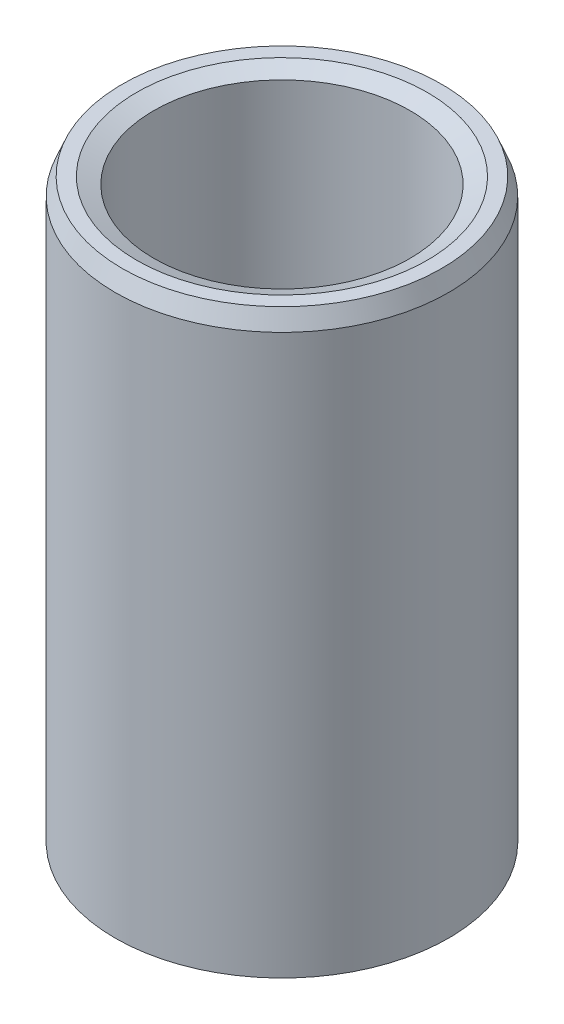
ISO-10303-21;
HEADER;
FILE_DESCRIPTION(('STEP AP214'),'2;1');
FILE_NAME('part.step','',(''),(''),'','','');
FILE_SCHEMA(('AUTOMOTIVE_DESIGN { 1 0 10303 214 1 1 1 1 }'));
ENDSEC;
DATA;
#1=APPLICATION_CONTEXT('core data for automotive mechanical design processes');
#2=APPLICATION_PROTOCOL_DEFINITION('international standard','automotive_design',2000,#1);
#3=PRODUCT_CONTEXT('',#1,'mechanical');
#4=PRODUCT('Part','Part','',(#3));
#5=PRODUCT_RELATED_PRODUCT_CATEGORY('part','',(#4));
#6=PRODUCT_DEFINITION_FORMATION('','',#4);
#7=PRODUCT_DEFINITION_CONTEXT('part definition',#1,'design');
#8=PRODUCT_DEFINITION('design','',#6,#7);
#9=PRODUCT_DEFINITION_SHAPE('','',#8);
#10=(LENGTH_UNIT() NAMED_UNIT(*) SI_UNIT(.MILLI.,.METRE.));
#11=(NAMED_UNIT(*) PLANE_ANGLE_UNIT() SI_UNIT($,.RADIAN.));
#12=(NAMED_UNIT(*) SI_UNIT($,.STERADIAN.) SOLID_ANGLE_UNIT());
#13=UNCERTAINTY_MEASURE_WITH_UNIT(LENGTH_MEASURE(1.E-05),#10,'distance_accuracy_value','');
#14=(GEOMETRIC_REPRESENTATION_CONTEXT(3) GLOBAL_UNCERTAINTY_ASSIGNED_CONTEXT((#13)) GLOBAL_UNIT_ASSIGNED_CONTEXT((#10,
#11,#12)) REPRESENTATION_CONTEXT('',''));
#15=CARTESIAN_POINT('',(0.,0.,0.));
#16=DIRECTION('',(0.,0.,1.));
#17=DIRECTION('',(1.,0.,0.));
#18=AXIS2_PLACEMENT_3D('',#15,#16,#17);
#19=CARTESIAN_POINT('',(0.,87.4802966100454,0.));
#20=DIRECTION('',(0.,-1.,0.));
#21=DIRECTION('',(0.,0.,-1.));
#22=AXIS2_PLACEMENT_3D('',#19,#20,#21);
#23=CYLINDRICAL_SURFACE('',#22,25.);
#24=CARTESIAN_POINT('',(0.,1.05765677502039,0.));
#25=DIRECTION('',(0.,1.,0.));
#26=DIRECTION('',(0.,0.,1.));
#27=AXIS2_PLACEMENT_3D('',#24,#25,#26);
#28=CIRCLE('',#27,25.);
#29=CARTESIAN_POINT('',(0.,1.05765677502039,25.));
#30=VERTEX_POINT('',#29);
#31=EDGE_CURVE('E10',#30,#30,#28,.T.);
#32=ORIENTED_EDGE('',*,*,#31,.T.);
#33=EDGE_LOOP('',(#32));
#34=FACE_BOUND('',#33,.T.);
#35=CARTESIAN_POINT('',(0.,84.8896900460195,0.));
#36=DIRECTION('',(0.,1.,0.));
#37=DIRECTION('',(0.,0.,1.));
#38=AXIS2_PLACEMENT_3D('',#35,#36,#37);
#39=CIRCLE('',#38,25.);
#40=CARTESIAN_POINT('',(0.,84.8896900460195,25.));
#41=VERTEX_POINT('',#40);
#42=EDGE_CURVE('E50',#41,#41,#39,.F.);
#43=ORIENTED_EDGE('',*,*,#42,.T.);
#44=EDGE_LOOP('',(#43));
#45=FACE_BOUND('',#44,.T.);
#46=ADVANCED_FACE('F39',(#34,#45),#23,.T.);
#47=CARTESIAN_POINT('',(0.,87.4802966100454,0.));
#48=DIRECTION('',(0.,1.,0.));
#49=DIRECTION('',(0.,0.,1.));
#50=AXIS2_PLACEMENT_3D('',#47,#48,#49);
#51=PLANE('',#50);
#52=CARTESIAN_POINT('',(0.,87.4802966100454,0.));
#53=DIRECTION('',(0.,1.,0.));
#54=DIRECTION('',(0.,0.,1.));
#55=AXIS2_PLACEMENT_3D('',#52,#53,#54);
#56=CIRCLE('',#55,21.7980158126669);
#57=CARTESIAN_POINT('',(0.,87.4802966100454,21.7980158126669));
#58=VERTEX_POINT('',#57);
#59=EDGE_CURVE('E58',#58,#58,#56,.F.);
#60=ORIENTED_EDGE('',*,*,#59,.T.);
#61=EDGE_LOOP('',(#60));
#62=FACE_BOUND('',#61,.T.);
#63=CARTESIAN_POINT('',(0.,87.4802966100454,0.));
#64=DIRECTION('',(0.,1.,0.));
#65=DIRECTION('',(0.,0.,1.));
#66=AXIS2_PLACEMENT_3D('',#63,#64,#65);
#67=CIRCLE('',#66,23.9423432249796);
#68=CARTESIAN_POINT('',(0.,87.4802966100454,23.9423432249796));
#69=VERTEX_POINT('',#68);
#70=EDGE_CURVE('E61',#69,#69,#67,.T.);
#71=ORIENTED_EDGE('',*,*,#70,.T.);
#72=EDGE_LOOP('',(#71));
#73=FACE_BOUND('',#72,.T.);
#74=ADVANCED_FACE('F88',(#62,#73),#51,.T.);
#75=CARTESIAN_POINT('',(0.,0.,0.));
#76=DIRECTION('',(0.,1.,0.));
#77=DIRECTION('',(0.,0.,1.));
#78=AXIS2_PLACEMENT_3D('',#75,#76,#77);
#79=PLANE('',#78);
#80=CARTESIAN_POINT('',(0.,0.,0.));
#81=DIRECTION('',(0.,1.,0.));
#82=DIRECTION('',(0.,0.,1.));
#83=AXIS2_PLACEMENT_3D('',#80,#81,#82);
#84=CIRCLE('',#83,20.2650660236615);
#85=CARTESIAN_POINT('',(0.,0.,20.2650660236615));
#86=VERTEX_POINT('',#85);
#87=EDGE_CURVE('E51',#86,#86,#84,.T.);
#88=ORIENTED_EDGE('',*,*,#87,.T.);
#89=EDGE_LOOP('',(#88));
#90=FACE_BOUND('',#89,.T.);
#91=CARTESIAN_POINT('',(0.,0.,0.));
#92=DIRECTION('',(0.,1.,0.));
#93=DIRECTION('',(0.,0.,1.));
#94=AXIS2_PLACEMENT_3D('',#91,#92,#93);
#95=CIRCLE('',#94,22.4093934359742);
#96=CARTESIAN_POINT('',(0.,0.,22.4093934359742));
#97=VERTEX_POINT('',#96);
#98=EDGE_CURVE('E54',#97,#97,#95,.F.);
#99=ORIENTED_EDGE('',*,*,#98,.T.);
#100=EDGE_LOOP('',(#99));
#101=FACE_BOUND('',#100,.T.);
#102=ADVANCED_FACE('F83',(#90,#101),#79,.F.);
#103=CARTESIAN_POINT('',(0.,87.4802966100454,0.));
#104=DIRECTION('',(0.,-1.,0.));
#105=DIRECTION('',(0.,0.,-1.));
#106=AXIS2_PLACEMENT_3D('',#103,#104,#105);
#107=CYLINDRICAL_SURFACE('',#106,19.2074092486411);
#108=CARTESIAN_POINT('',(0.,86.422639835025,0.));
#109=DIRECTION('',(0.,1.,0.));
#110=DIRECTION('',(0.,0.,1.));
#111=AXIS2_PLACEMENT_3D('',#108,#109,#110);
#112=CIRCLE('',#111,19.2074092486411);
#113=CARTESIAN_POINT('',(0.,86.422639835025,19.2074092486411));
#114=VERTEX_POINT('',#113);
#115=EDGE_CURVE('E67',#114,#114,#112,.T.);
#116=ORIENTED_EDGE('',*,*,#115,.T.);
#117=EDGE_LOOP('',(#116));
#118=FACE_BOUND('',#117,.T.);
#119=CARTESIAN_POINT('',(0.,2.59060656402585,0.));
#120=DIRECTION('',(0.,1.,0.));
#121=DIRECTION('',(0.,0.,1.));
#122=AXIS2_PLACEMENT_3D('',#119,#120,#121);
#123=CIRCLE('',#122,19.2074092486411);
#124=CARTESIAN_POINT('',(0.,2.59060656402585,19.2074092486411));
#125=VERTEX_POINT('',#124);
#126=EDGE_CURVE('E69',#125,#125,#123,.F.);
#127=ORIENTED_EDGE('',*,*,#126,.T.);
#128=EDGE_LOOP('',(#127));
#129=FACE_BOUND('',#128,.T.);
#130=ADVANCED_FACE('F71',(#118,#129),#107,.F.);
#131=CARTESIAN_POINT('',(0.,86.422639835025,0.));
#132=DIRECTION('',(0.,1.,0.));
#133=DIRECTION('',(0.,0.,1.));
#134=AXIS2_PLACEMENT_3D('',#131,#132,#133);
#135=CONICAL_SURFACE('',#134,19.2074092486411,1.1831843959308);
#136=ORIENTED_EDGE('',*,*,#59,.F.);
#137=EDGE_LOOP('',(#136));
#138=FACE_BOUND('',#137,.T.);
#139=ORIENTED_EDGE('',*,*,#115,.F.);
#140=EDGE_LOOP('',(#139));
#141=FACE_BOUND('',#140,.T.);
#142=ADVANCED_FACE('F77',(#138,#141),#135,.F.);
#143=CARTESIAN_POINT('',(0.,0.,0.));
#144=DIRECTION('',(0.,-1.,0.));
#145=DIRECTION('',(0.,0.,-1.));
#146=AXIS2_PLACEMENT_3D('',#143,#144,#145);
#147=CONICAL_SURFACE('',#146,20.2650660236615,0.3876119308641);
#148=ORIENTED_EDGE('',*,*,#126,.F.);
#149=EDGE_LOOP('',(#148));
#150=FACE_BOUND('',#149,.T.);
#151=ORIENTED_EDGE('',*,*,#87,.F.);
#152=EDGE_LOOP('',(#151));
#153=FACE_BOUND('',#152,.T.);
#154=ADVANCED_FACE('F73',(#150,#153),#147,.F.);
#155=CARTESIAN_POINT('',(0.,1.05765677502039,0.));
#156=DIRECTION('',(0.,1.,0.));
#157=DIRECTION('',(0.,0.,1.));
#158=AXIS2_PLACEMENT_3D('',#155,#156,#157);
#159=CONICAL_SURFACE('',#158,25.,1.1831843959308);
#160=ORIENTED_EDGE('',*,*,#98,.F.);
#161=EDGE_LOOP('',(#160));
#162=FACE_BOUND('',#161,.T.);
#163=ORIENTED_EDGE('',*,*,#31,.F.);
#164=EDGE_LOOP('',(#163));
#165=FACE_BOUND('',#164,.T.);
#166=ADVANCED_FACE('F76',(#162,#165),#159,.T.);
#167=CARTESIAN_POINT('',(0.,87.4802966100454,0.));
#168=DIRECTION('',(0.,-1.,0.));
#169=DIRECTION('',(0.,0.,-1.));
#170=AXIS2_PLACEMENT_3D('',#167,#168,#169);
#171=CONICAL_SURFACE('',#170,23.9423432249796,0.387611930864097);
#172=ORIENTED_EDGE('',*,*,#42,.F.);
#173=EDGE_LOOP('',(#172));
#174=FACE_BOUND('',#173,.T.);
#175=ORIENTED_EDGE('',*,*,#70,.F.);
#176=EDGE_LOOP('',(#175));
#177=FACE_BOUND('',#176,.T.);
#178=ADVANCED_FACE('F45',(#174,#177),#171,.T.);
#179=CLOSED_SHELL('',(#46,#74,#102,#130,#142,#154,#166,#178));
#180=MANIFOLD_SOLID_BREP('B2',#179);
#181=ADVANCED_BREP_SHAPE_REPRESENTATION('',(#18,#180),#14);
#182=SHAPE_DEFINITION_REPRESENTATION(#9,#181);
ENDSEC;
END-ISO-10303-21;
